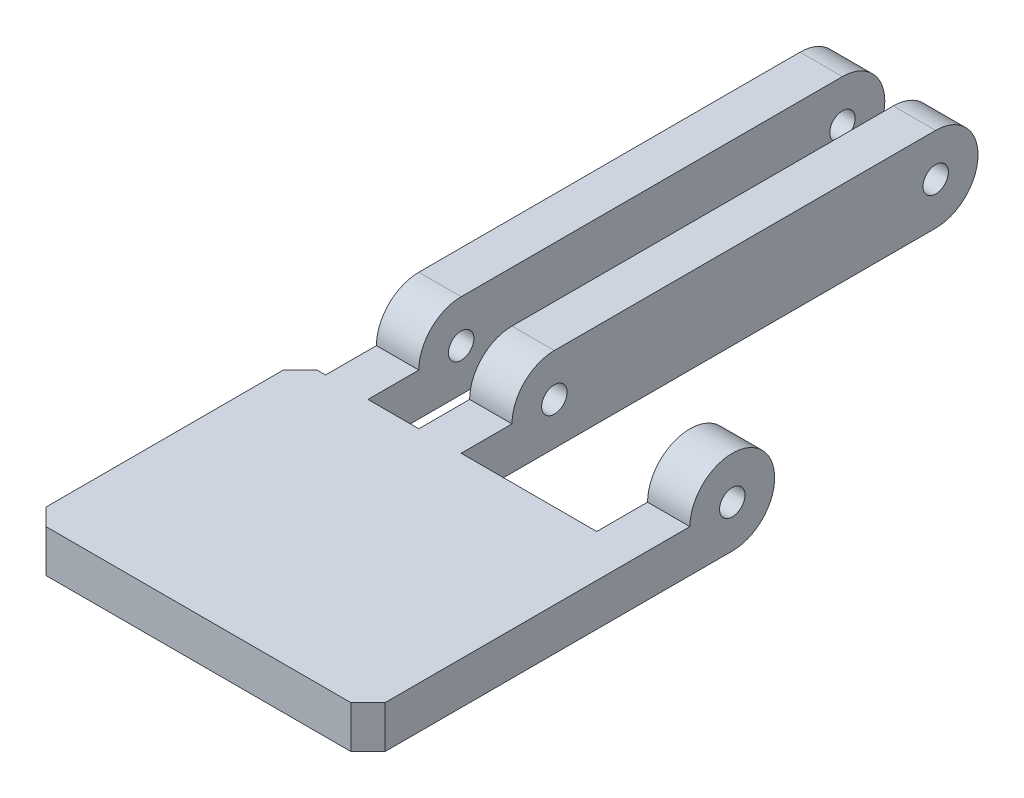
ISO-10303-21;
HEADER;
FILE_DESCRIPTION(('STEP AP214'),'2;1');
FILE_NAME('part.step','',(''),(''),'','','');
FILE_SCHEMA(('AUTOMOTIVE_DESIGN { 1 0 10303 214 1 1 1 1 }'));
ENDSEC;
DATA;
#1=APPLICATION_CONTEXT('core data for automotive mechanical design processes');
#2=APPLICATION_PROTOCOL_DEFINITION('international standard','automotive_design',2000,#1);
#3=PRODUCT_CONTEXT('',#1,'mechanical');
#4=PRODUCT('Part','Part','',(#3));
#5=PRODUCT_RELATED_PRODUCT_CATEGORY('part','',(#4));
#6=PRODUCT_DEFINITION_FORMATION('','',#4);
#7=PRODUCT_DEFINITION_CONTEXT('part definition',#1,'design');
#8=PRODUCT_DEFINITION('design','',#6,#7);
#9=PRODUCT_DEFINITION_SHAPE('','',#8);
#10=(LENGTH_UNIT() NAMED_UNIT(*) SI_UNIT(.MILLI.,.METRE.));
#11=(NAMED_UNIT(*) PLANE_ANGLE_UNIT() SI_UNIT($,.RADIAN.));
#12=(NAMED_UNIT(*) SI_UNIT($,.STERADIAN.) SOLID_ANGLE_UNIT());
#13=UNCERTAINTY_MEASURE_WITH_UNIT(LENGTH_MEASURE(1.E-05),#10,'distance_accuracy_value','');
#14=(GEOMETRIC_REPRESENTATION_CONTEXT(3) GLOBAL_UNCERTAINTY_ASSIGNED_CONTEXT((#13)) GLOBAL_UNIT_ASSIGNED_CONTEXT((#10,
#11,#12)) REPRESENTATION_CONTEXT('',''));
#15=CARTESIAN_POINT('',(0.,0.,0.));
#16=DIRECTION('',(0.,0.,1.));
#17=DIRECTION('',(1.,0.,0.));
#18=AXIS2_PLACEMENT_3D('',#15,#16,#17);
#19=CARTESIAN_POINT('',(-25.,5.,-18.));
#20=DIRECTION('',(1.,0.,0.));
#21=DIRECTION('',(0.,0.,-1.));
#22=AXIS2_PLACEMENT_3D('',#19,#20,#21);
#23=CYLINDRICAL_SURFACE('',#22,1.5);
#24=CARTESIAN_POINT('',(-22.,5.,-18.));
#25=DIRECTION('',(1.,0.,0.));
#26=DIRECTION('',(0.,0.,-1.));
#27=AXIS2_PLACEMENT_3D('',#24,#25,#26);
#28=CIRCLE('',#27,1.5);
#29=CARTESIAN_POINT('',(-22.,5.,-19.5));
#30=VERTEX_POINT('',#29);
#31=EDGE_CURVE('E349',#30,#30,#28,.T.);
#32=ORIENTED_EDGE('',*,*,#31,.F.);
#33=EDGE_LOOP('',(#32));
#34=FACE_BOUND('',#33,.T.);
#35=CARTESIAN_POINT('',(-17.,5.,-18.));
#36=DIRECTION('',(1.,0.,0.));
#37=DIRECTION('',(0.,0.,-1.));
#38=AXIS2_PLACEMENT_3D('',#35,#36,#37);
#39=CIRCLE('',#38,1.5);
#40=CARTESIAN_POINT('',(-17.,5.,-19.5));
#41=VERTEX_POINT('',#40);
#42=EDGE_CURVE('E262',#41,#41,#39,.T.);
#43=ORIENTED_EDGE('',*,*,#42,.T.);
#44=EDGE_LOOP('',(#43));
#45=FACE_BOUND('',#44,.T.);
#46=ADVANCED_FACE('F45',(#34,#45),#23,.F.);
#47=CARTESIAN_POINT('',(-11.,5.,-18.));
#48=DIRECTION('',(1.,0.,0.));
#49=DIRECTION('',(0.,0.,-1.));
#50=AXIS2_PLACEMENT_3D('',#47,#48,#49);
#51=CIRCLE('',#50,1.5);
#52=CARTESIAN_POINT('',(-11.,5.,-19.5));
#53=VERTEX_POINT('',#52);
#54=EDGE_CURVE('E265',#53,#53,#51,.T.);
#55=ORIENTED_EDGE('',*,*,#54,.F.);
#56=EDGE_LOOP('',(#55));
#57=FACE_BOUND('',#56,.T.);
#58=CARTESIAN_POINT('',(-6.,5.,-18.));
#59=DIRECTION('',(1.,0.,0.));
#60=DIRECTION('',(0.,0.,-1.));
#61=AXIS2_PLACEMENT_3D('',#58,#59,#60);
#62=CIRCLE('',#61,1.5);
#63=CARTESIAN_POINT('',(-6.,5.,-19.5));
#64=VERTEX_POINT('',#63);
#65=EDGE_CURVE('E268',#64,#64,#62,.T.);
#66=ORIENTED_EDGE('',*,*,#65,.T.);
#67=EDGE_LOOP('',(#66));
#68=FACE_BOUND('',#67,.T.);
#69=ADVANCED_FACE('F460',(#57,#68),#23,.F.);
#70=CARTESIAN_POINT('',(0.,5.,0.));
#71=DIRECTION('',(0.,1.,0.));
#72=DIRECTION('',(0.,0.,1.));
#73=AXIS2_PLACEMENT_3D('',#70,#71,#72);
#74=PLANE('',#73);
#75=DIRECTION('',(1.,0.,0.));
#76=VECTOR('',#75,1.);
#77=CARTESIAN_POINT('',(0.,5.,-7.00000000000001));
#78=LINE('',#77,#76);
#79=CARTESIAN_POINT('',(-23.,5.,-7.));
#80=VERTEX_POINT('',#79);
#81=CARTESIAN_POINT('',(-22.,5.,-7.));
#82=VERTEX_POINT('',#81);
#83=EDGE_CURVE('E217',#80,#82,#78,.T.);
#84=ORIENTED_EDGE('',*,*,#83,.F.);
#85=DIRECTION('',(0.707106781186547,0.,-0.707106781186548));
#86=VECTOR('',#85,1.);
#87=CARTESIAN_POINT('',(-15.,5.,-15.));
#88=LINE('',#87,#86);
#89=CARTESIAN_POINT('',(-25.,5.,-4.99999999999998));
#90=VERTEX_POINT('',#89);
#91=EDGE_CURVE('E368',#80,#90,#88,.F.);
#92=ORIENTED_EDGE('',*,*,#91,.T.);
#93=DIRECTION('',(0.,0.,1.));
#94=VECTOR('',#93,1.);
#95=CARTESIAN_POINT('',(-25.,5.,-18.));
#96=LINE('',#95,#94);
#97=CARTESIAN_POINT('',(-25.,5.,23.));
#98=VERTEX_POINT('',#97);
#99=EDGE_CURVE('E342',#90,#98,#96,.T.);
#100=ORIENTED_EDGE('',*,*,#99,.T.);
#101=DIRECTION('',(-0.707106781186547,0.,-0.707106781186548));
#102=VECTOR('',#101,1.);
#103=CARTESIAN_POINT('',(-24.,5.,24.));
#104=LINE('',#103,#102);
#105=CARTESIAN_POINT('',(-23.,5.,25.));
#106=VERTEX_POINT('',#105);
#107=EDGE_CURVE('E364',#98,#106,#104,.F.);
#108=ORIENTED_EDGE('',*,*,#107,.T.);
#109=DIRECTION('',(1.,0.,0.));
#110=VECTOR('',#109,1.);
#111=CARTESIAN_POINT('',(-25.,5.,25.));
#112=LINE('',#111,#110);
#113=CARTESIAN_POINT('',(13.,5.,25.));
#114=VERTEX_POINT('',#113);
#115=EDGE_CURVE('E345',#106,#114,#112,.T.);
#116=ORIENTED_EDGE('',*,*,#115,.T.);
#117=DIRECTION('',(0.707106781186546,0.,-0.707106781186549));
#118=VECTOR('',#117,1.);
#119=CARTESIAN_POINT('',(19.,5.,19.));
#120=LINE('',#119,#118);
#121=CARTESIAN_POINT('',(15.,5.,23.));
#122=VERTEX_POINT('',#121);
#123=EDGE_CURVE('E366',#114,#122,#120,.T.);
#124=ORIENTED_EDGE('',*,*,#123,.T.);
#125=DIRECTION('',(0.,0.,1.));
#126=VECTOR('',#125,1.);
#127=CARTESIAN_POINT('',(15.,5.,0.));
#128=LINE('',#127,#126);
#129=CARTESIAN_POINT('',(15.,5.,-13.));
#130=VERTEX_POINT('',#129);
#131=EDGE_CURVE('E218',#130,#122,#128,.T.);
#132=ORIENTED_EDGE('',*,*,#131,.F.);
#133=DIRECTION('',(1.,0.,0.));
#134=VECTOR('',#133,1.);
#135=CARTESIAN_POINT('',(10.,5.,-13.));
#136=LINE('',#135,#134);
#137=CARTESIAN_POINT('',(10.,5.,-13.));
#138=VERTEX_POINT('',#137);
#139=EDGE_CURVE('E337',#138,#130,#136,.T.);
#140=ORIENTED_EDGE('',*,*,#139,.F.);
#141=DIRECTION('',(0.,0.,-1.));
#142=VECTOR('',#141,1.);
#143=CARTESIAN_POINT('',(10.,5.,0.));
#144=LINE('',#143,#142);
#145=CARTESIAN_POINT('',(10.,5.,-7.));
#146=VERTEX_POINT('',#145);
#147=EDGE_CURVE('E221',#146,#138,#144,.T.);
#148=ORIENTED_EDGE('',*,*,#147,.F.);
#149=DIRECTION('',(1.,0.,0.));
#150=VECTOR('',#149,1.);
#151=CARTESIAN_POINT('',(0.,5.,-7.));
#152=LINE('',#151,#150);
#153=CARTESIAN_POINT('',(-6.,5.,-7.));
#154=VERTEX_POINT('',#153);
#155=EDGE_CURVE('E257',#154,#146,#152,.T.);
#156=ORIENTED_EDGE('',*,*,#155,.F.);
#157=DIRECTION('',(0.,0.,1.));
#158=VECTOR('',#157,1.);
#159=CARTESIAN_POINT('',(-6.,5.,0.));
#160=LINE('',#159,#158);
#161=CARTESIAN_POINT('',(-6.,5.,-13.));
#162=VERTEX_POINT('',#161);
#163=EDGE_CURVE('E249',#162,#154,#160,.T.);
#164=ORIENTED_EDGE('',*,*,#163,.F.);
#165=DIRECTION('',(1.,0.,0.));
#166=VECTOR('',#165,1.);
#167=CARTESIAN_POINT('',(-11.,5.,-13.));
#168=LINE('',#167,#166);
#169=CARTESIAN_POINT('',(-11.,5.,-13.));
#170=VERTEX_POINT('',#169);
#171=EDGE_CURVE('E328',#170,#162,#168,.T.);
#172=ORIENTED_EDGE('',*,*,#171,.F.);
#173=DIRECTION('',(0.,0.,-1.));
#174=VECTOR('',#173,1.);
#175=CARTESIAN_POINT('',(-11.,5.,0.));
#176=LINE('',#175,#174);
#177=CARTESIAN_POINT('',(-11.,5.,-7.));
#178=VERTEX_POINT('',#177);
#179=EDGE_CURVE('E251',#178,#170,#176,.T.);
#180=ORIENTED_EDGE('',*,*,#179,.F.);
#181=DIRECTION('',(1.,0.,0.));
#182=VECTOR('',#181,1.);
#183=CARTESIAN_POINT('',(0.,5.,-7.));
#184=LINE('',#183,#182);
#185=CARTESIAN_POINT('',(-17.,5.,-7.));
#186=VERTEX_POINT('',#185);
#187=EDGE_CURVE('E259',#186,#178,#184,.T.);
#188=ORIENTED_EDGE('',*,*,#187,.F.);
#189=DIRECTION('',(0.,0.,1.));
#190=VECTOR('',#189,1.);
#191=CARTESIAN_POINT('',(-17.,5.,0.));
#192=LINE('',#191,#190);
#193=CARTESIAN_POINT('',(-17.,5.,-13.));
#194=VERTEX_POINT('',#193);
#195=EDGE_CURVE('E253',#194,#186,#192,.T.);
#196=ORIENTED_EDGE('',*,*,#195,.F.);
#197=DIRECTION('',(-1.,0.,0.));
#198=VECTOR('',#197,1.);
#199=CARTESIAN_POINT('',(-17.,5.,-13.));
#200=LINE('',#199,#198);
#201=CARTESIAN_POINT('',(-22.,5.,-13.));
#202=VERTEX_POINT('',#201);
#203=EDGE_CURVE('E299',#194,#202,#200,.T.);
#204=ORIENTED_EDGE('',*,*,#203,.T.);
#205=DIRECTION('',(0.,0.,-1.));
#206=VECTOR('',#205,1.);
#207=CARTESIAN_POINT('',(-22.,5.,0.));
#208=LINE('',#207,#206);
#209=EDGE_CURVE('E255',#82,#202,#208,.T.);
#210=ORIENTED_EDGE('',*,*,#209,.F.);
#211=EDGE_LOOP('',(#84,#92,#100,#108,#116,#124,#132,#140,#148,#156,#164,#172,#180,#188,#196,
#204,#210));
#212=FACE_BOUND('',#211,.T.);
#213=ADVANCED_FACE('F385',(#212),#74,.T.);
#214=CARTESIAN_POINT('',(-25.,5.,-18.));
#215=DIRECTION('',(1.,0.,0.));
#216=DIRECTION('',(0.,0.,-1.));
#217=AXIS2_PLACEMENT_3D('',#214,#215,#216);
#218=PLANE('',#217);
#219=ORIENTED_EDGE('',*,*,#99,.F.);
#220=DIRECTION('',(0.,-1.,0.));
#221=VECTOR('',#220,1.);
#222=CARTESIAN_POINT('',(-25.,5.,-4.99999999999998));
#223=LINE('',#222,#221);
#224=CARTESIAN_POINT('',(-25.,0.,-4.99999999999998));
#225=VERTEX_POINT('',#224);
#226=EDGE_CURVE('E372',#90,#225,#223,.T.);
#227=ORIENTED_EDGE('',*,*,#226,.T.);
#228=DIRECTION('',(0.,0.,1.));
#229=VECTOR('',#228,1.);
#230=CARTESIAN_POINT('',(-25.,0.,-18.));
#231=LINE('',#230,#229);
#232=CARTESIAN_POINT('',(-25.,0.,23.));
#233=VERTEX_POINT('',#232);
#234=EDGE_CURVE('E352',#225,#233,#231,.T.);
#235=ORIENTED_EDGE('',*,*,#234,.T.);
#236=DIRECTION('',(0.,1.,0.));
#237=VECTOR('',#236,1.);
#238=CARTESIAN_POINT('',(-25.,5.,23.));
#239=LINE('',#238,#237);
#240=EDGE_CURVE('E370',#233,#98,#239,.T.);
#241=ORIENTED_EDGE('',*,*,#240,.T.);
#242=EDGE_LOOP('',(#219,#227,#235,#241));
#243=FACE_BOUND('',#242,.T.);
#244=ADVANCED_FACE('F390',(#243),#218,.F.);
#245=CARTESIAN_POINT('',(-25.,5.,25.));
#246=DIRECTION('',(0.,0.,-1.));
#247=DIRECTION('',(-1.,0.,0.));
#248=AXIS2_PLACEMENT_3D('',#245,#246,#247);
#249=PLANE('',#248);
#250=DIRECTION('',(1.,0.,0.));
#251=VECTOR('',#250,1.);
#252=CARTESIAN_POINT('',(-25.,0.,25.));
#253=LINE('',#252,#251);
#254=CARTESIAN_POINT('',(-23.,0.,25.));
#255=VERTEX_POINT('',#254);
#256=CARTESIAN_POINT('',(13.,0.,25.));
#257=VERTEX_POINT('',#256);
#258=EDGE_CURVE('E346',#255,#257,#253,.T.);
#259=ORIENTED_EDGE('',*,*,#258,.T.);
#260=DIRECTION('',(0.,1.,0.));
#261=VECTOR('',#260,1.);
#262=CARTESIAN_POINT('',(13.,5.,25.));
#263=LINE('',#262,#261);
#264=EDGE_CURVE('E54',#257,#114,#263,.T.);
#265=ORIENTED_EDGE('',*,*,#264,.T.);
#266=ORIENTED_EDGE('',*,*,#115,.F.);
#267=DIRECTION('',(0.,-1.,0.));
#268=VECTOR('',#267,1.);
#269=CARTESIAN_POINT('',(-23.,5.,25.));
#270=LINE('',#269,#268);
#271=EDGE_CURVE('E377',#106,#255,#270,.T.);
#272=ORIENTED_EDGE('',*,*,#271,.T.);
#273=EDGE_LOOP('',(#259,#265,#266,#272));
#274=FACE_BOUND('',#273,.T.);
#275=ADVANCED_FACE('F382',(#274),#249,.F.);
#276=CARTESIAN_POINT('',(0.,0.,0.));
#277=DIRECTION('',(0.,1.,0.));
#278=DIRECTION('',(0.,0.,1.));
#279=AXIS2_PLACEMENT_3D('',#276,#277,#278);
#280=PLANE('',#279);
#281=ORIENTED_EDGE('',*,*,#234,.F.);
#282=DIRECTION('',(-0.707106781186547,0.,0.707106781186548));
#283=VECTOR('',#282,1.);
#284=CARTESIAN_POINT('',(-23.,0.,-7.));
#285=LINE('',#284,#283);
#286=CARTESIAN_POINT('',(-23.,0.,-7.));
#287=VERTEX_POINT('',#286);
#288=EDGE_CURVE('E197',#225,#287,#285,.F.);
#289=ORIENTED_EDGE('',*,*,#288,.T.);
#290=DIRECTION('',(1.,0.,0.));
#291=VECTOR('',#290,1.);
#292=CARTESIAN_POINT('',(-25.,0.,-7.));
#293=LINE('',#292,#291);
#294=CARTESIAN_POINT('',(-22.,0.,-7.));
#295=VERTEX_POINT('',#294);
#296=EDGE_CURVE('E190',#287,#295,#293,.T.);
#297=ORIENTED_EDGE('',*,*,#296,.T.);
#298=DIRECTION('',(0.,0.,-1.));
#299=VECTOR('',#298,1.);
#300=CARTESIAN_POINT('',(-22.,0.,0.));
#301=LINE('',#300,#299);
#302=CARTESIAN_POINT('',(-22.,0.,-63.));
#303=VERTEX_POINT('',#302);
#304=EDGE_CURVE('E195',#295,#303,#301,.T.);
#305=ORIENTED_EDGE('',*,*,#304,.T.);
#306=DIRECTION('',(-1.,0.,0.));
#307=VECTOR('',#306,1.);
#308=CARTESIAN_POINT('',(-17.,0.,-63.));
#309=LINE('',#308,#307);
#310=CARTESIAN_POINT('',(-17.,0.,-63.));
#311=VERTEX_POINT('',#310);
#312=EDGE_CURVE('E297',#311,#303,#309,.T.);
#313=ORIENTED_EDGE('',*,*,#312,.F.);
#314=DIRECTION('',(0.,0.,-1.));
#315=VECTOR('',#314,1.);
#316=CARTESIAN_POINT('',(-17.,0.,0.));
#317=LINE('',#316,#315);
#318=CARTESIAN_POINT('',(-17.,0.,-7.));
#319=VERTEX_POINT('',#318);
#320=EDGE_CURVE('E276',#319,#311,#317,.T.);
#321=ORIENTED_EDGE('',*,*,#320,.F.);
#322=DIRECTION('',(1.,0.,0.));
#323=VECTOR('',#322,1.);
#324=CARTESIAN_POINT('',(-17.,0.,-7.));
#325=LINE('',#324,#323);
#326=CARTESIAN_POINT('',(-11.,0.,-7.));
#327=VERTEX_POINT('',#326);
#328=EDGE_CURVE('E203',#319,#327,#325,.T.);
#329=ORIENTED_EDGE('',*,*,#328,.T.);
#330=DIRECTION('',(0.,0.,-1.));
#331=VECTOR('',#330,1.);
#332=CARTESIAN_POINT('',(-11.,0.,-18.));
#333=LINE('',#332,#331);
#334=CARTESIAN_POINT('',(-11.,0.,-63.));
#335=VERTEX_POINT('',#334);
#336=EDGE_CURVE('E306',#327,#335,#333,.T.);
#337=ORIENTED_EDGE('',*,*,#336,.T.);
#338=DIRECTION('',(1.,0.,0.));
#339=VECTOR('',#338,1.);
#340=CARTESIAN_POINT('',(-11.,0.,-63.));
#341=LINE('',#340,#339);
#342=CARTESIAN_POINT('',(-6.,0.,-63.));
#343=VERTEX_POINT('',#342);
#344=EDGE_CURVE('E315',#335,#343,#341,.T.);
#345=ORIENTED_EDGE('',*,*,#344,.T.);
#346=DIRECTION('',(0.,0.,-1.));
#347=VECTOR('',#346,1.);
#348=CARTESIAN_POINT('',(-6.,0.,-18.));
#349=LINE('',#348,#347);
#350=CARTESIAN_POINT('',(-6.,0.,-7.));
#351=VERTEX_POINT('',#350);
#352=EDGE_CURVE('E318',#351,#343,#349,.T.);
#353=ORIENTED_EDGE('',*,*,#352,.F.);
#354=DIRECTION('',(1.,0.,0.));
#355=VECTOR('',#354,1.);
#356=CARTESIAN_POINT('',(-6.,0.,-7.));
#357=LINE('',#356,#355);
#358=CARTESIAN_POINT('',(10.,0.,-7.));
#359=VERTEX_POINT('',#358);
#360=EDGE_CURVE('E231',#351,#359,#357,.T.);
#361=ORIENTED_EDGE('',*,*,#360,.T.);
#362=DIRECTION('',(0.,0.,-1.));
#363=VECTOR('',#362,1.);
#364=CARTESIAN_POINT('',(10.,0.,-18.));
#365=LINE('',#364,#363);
#366=CARTESIAN_POINT('',(10.,0.,-18.));
#367=VERTEX_POINT('',#366);
#368=EDGE_CURVE('E237',#359,#367,#365,.T.);
#369=ORIENTED_EDGE('',*,*,#368,.T.);
#370=DIRECTION('',(-1.,0.,0.));
#371=VECTOR('',#370,1.);
#372=CARTESIAN_POINT('',(-25.,0.,-18.));
#373=LINE('',#372,#371);
#374=CARTESIAN_POINT('',(15.,0.,-18.));
#375=VERTEX_POINT('',#374);
#376=EDGE_CURVE('E341',#375,#367,#373,.T.);
#377=ORIENTED_EDGE('',*,*,#376,.F.);
#378=DIRECTION('',(0.,0.,1.));
#379=VECTOR('',#378,1.);
#380=CARTESIAN_POINT('',(15.,0.,-18.));
#381=LINE('',#380,#379);
#382=CARTESIAN_POINT('',(15.,0.,23.));
#383=VERTEX_POINT('',#382);
#384=EDGE_CURVE('E241',#375,#383,#381,.T.);
#385=ORIENTED_EDGE('',*,*,#384,.T.);
#386=DIRECTION('',(-0.707106781186546,0.,0.707106781186549));
#387=VECTOR('',#386,1.);
#388=CARTESIAN_POINT('',(13.,0.,25.));
#389=LINE('',#388,#387);
#390=EDGE_CURVE('E61',#383,#257,#389,.T.);
#391=ORIENTED_EDGE('',*,*,#390,.T.);
#392=ORIENTED_EDGE('',*,*,#258,.F.);
#393=DIRECTION('',(0.707106781186547,0.,0.707106781186548));
#394=VECTOR('',#393,1.);
#395=CARTESIAN_POINT('',(-23.,0.,25.));
#396=LINE('',#395,#394);
#397=EDGE_CURVE('E69',#255,#233,#396,.F.);
#398=ORIENTED_EDGE('',*,*,#397,.T.);
#399=EDGE_LOOP('',(#281,#289,#297,#305,#313,#321,#329,#337,#345,#353,#361,#369,#377,#385,#391,
#392,#398));
#400=FACE_BOUND('',#399,.T.);
#401=ADVANCED_FACE('F193',(#400),#280,.F.);
#402=CARTESIAN_POINT('',(10.,5.,-18.));
#403=DIRECTION('',(1.,0.,0.));
#404=DIRECTION('',(0.,0.,-1.));
#405=AXIS2_PLACEMENT_3D('',#402,#403,#404);
#406=PLANE('',#405);
#407=CARTESIAN_POINT('',(9.99999999999999,5.,-18.));
#408=DIRECTION('',(1.,0.,0.));
#409=DIRECTION('',(0.,0.,-1.));
#410=AXIS2_PLACEMENT_3D('',#407,#408,#409);
#411=CIRCLE('',#410,1.5);
#412=CARTESIAN_POINT('',(9.99999999999999,5.,-19.5));
#413=VERTEX_POINT('',#412);
#414=EDGE_CURVE('E271',#413,#413,#411,.T.);
#415=ORIENTED_EDGE('',*,*,#414,.T.);
#416=EDGE_LOOP('',(#415));
#417=FACE_BOUND('',#416,.T.);
#418=ORIENTED_EDGE('',*,*,#147,.T.);
#419=CARTESIAN_POINT('',(10.,5.,-18.));
#420=DIRECTION('',(1.,0.,0.));
#421=DIRECTION('',(0.,0.,-1.));
#422=AXIS2_PLACEMENT_3D('',#419,#420,#421);
#423=CIRCLE('',#422,5.);
#424=EDGE_CURVE('E335',#367,#138,#423,.T.);
#425=ORIENTED_EDGE('',*,*,#424,.F.);
#426=ORIENTED_EDGE('',*,*,#368,.F.);
#427=DIRECTION('',(0.,1.,0.));
#428=VECTOR('',#427,1.);
#429=CARTESIAN_POINT('',(10.,0.,-7.));
#430=LINE('',#429,#428);
#431=EDGE_CURVE('E238',#359,#146,#430,.T.);
#432=ORIENTED_EDGE('',*,*,#431,.T.);
#433=EDGE_LOOP('',(#418,#425,#426,#432));
#434=FACE_BOUND('',#433,.T.);
#435=ADVANCED_FACE('F441',(#417,#434),#406,.F.);
#436=CARTESIAN_POINT('',(15.,5.,-18.));
#437=DIRECTION('',(1.,0.,0.));
#438=DIRECTION('',(0.,0.,-1.));
#439=AXIS2_PLACEMENT_3D('',#436,#437,#438);
#440=PLANE('',#439);
#441=CARTESIAN_POINT('',(15.,5.,-18.));
#442=DIRECTION('',(1.,0.,0.));
#443=DIRECTION('',(0.,0.,-1.));
#444=AXIS2_PLACEMENT_3D('',#441,#442,#443);
#445=CIRCLE('',#444,1.5);
#446=CARTESIAN_POINT('',(15.,5.,-19.5));
#447=VERTEX_POINT('',#446);
#448=EDGE_CURVE('E213',#447,#447,#445,.T.);
#449=ORIENTED_EDGE('',*,*,#448,.F.);
#450=EDGE_LOOP('',(#449));
#451=FACE_BOUND('',#450,.T.);
#452=ORIENTED_EDGE('',*,*,#131,.T.);
#453=DIRECTION('',(0.,-1.,0.));
#454=VECTOR('',#453,1.);
#455=CARTESIAN_POINT('',(15.,0.,23.));
#456=LINE('',#455,#454);
#457=EDGE_CURVE('E11',#122,#383,#456,.T.);
#458=ORIENTED_EDGE('',*,*,#457,.T.);
#459=ORIENTED_EDGE('',*,*,#384,.F.);
#460=CARTESIAN_POINT('',(15.,5.,-18.));
#461=DIRECTION('',(1.,0.,0.));
#462=DIRECTION('',(0.,0.,-1.));
#463=AXIS2_PLACEMENT_3D('',#460,#461,#462);
#464=CIRCLE('',#463,5.);
#465=EDGE_CURVE('E334',#375,#130,#464,.T.);
#466=ORIENTED_EDGE('',*,*,#465,.T.);
#467=EDGE_LOOP('',(#452,#458,#459,#466));
#468=FACE_BOUND('',#467,.T.);
#469=ADVANCED_FACE('F448',(#451,#468),#440,.T.);
#470=CARTESIAN_POINT('',(10.,5.,-18.));
#471=DIRECTION('',(1.,0.,0.));
#472=DIRECTION('',(0.,0.,-1.));
#473=AXIS2_PLACEMENT_3D('',#470,#471,#472);
#474=CYLINDRICAL_SURFACE('',#473,5.);
#475=ORIENTED_EDGE('',*,*,#424,.T.);
#476=ORIENTED_EDGE('',*,*,#139,.T.);
#477=ORIENTED_EDGE('',*,*,#465,.F.);
#478=ORIENTED_EDGE('',*,*,#376,.T.);
#479=EDGE_LOOP('',(#475,#476,#477,#478));
#480=FACE_BOUND('',#479,.T.);
#481=ADVANCED_FACE('F445',(#480),#474,.T.);
#482=CARTESIAN_POINT('',(-11.,5.,-18.));
#483=DIRECTION('',(1.,0.,0.));
#484=DIRECTION('',(0.,0.,-1.));
#485=AXIS2_PLACEMENT_3D('',#482,#483,#484);
#486=PLANE('',#485);
#487=CARTESIAN_POINT('',(-11.,5.,-63.));
#488=DIRECTION('',(1.,0.,0.));
#489=DIRECTION('',(0.,0.,-1.));
#490=AXIS2_PLACEMENT_3D('',#487,#488,#489);
#491=CIRCLE('',#490,1.5);
#492=CARTESIAN_POINT('',(-11.,5.,-64.5));
#493=VERTEX_POINT('',#492);
#494=EDGE_CURVE('E245',#493,#493,#491,.T.);
#495=ORIENTED_EDGE('',*,*,#494,.T.);
#496=EDGE_LOOP('',(#495));
#497=FACE_BOUND('',#496,.T.);
#498=ORIENTED_EDGE('',*,*,#54,.T.);
#499=EDGE_LOOP('',(#498));
#500=FACE_BOUND('',#499,.T.);
#501=ORIENTED_EDGE('',*,*,#179,.T.);
#502=CARTESIAN_POINT('',(-11.,5.,-18.));
#503=DIRECTION('',(1.,0.,0.));
#504=DIRECTION('',(0.,0.,-1.));
#505=AXIS2_PLACEMENT_3D('',#502,#503,#504);
#506=CIRCLE('',#505,5.);
#507=CARTESIAN_POINT('',(-11.,10.,-18.));
#508=VERTEX_POINT('',#507);
#509=EDGE_CURVE('E303',#508,#170,#506,.T.);
#510=ORIENTED_EDGE('',*,*,#509,.F.);
#511=DIRECTION('',(0.,0.,-1.));
#512=VECTOR('',#511,1.);
#513=CARTESIAN_POINT('',(-11.,10.,-18.));
#514=LINE('',#513,#512);
#515=CARTESIAN_POINT('',(-11.,10.,-63.));
#516=VERTEX_POINT('',#515);
#517=EDGE_CURVE('E313',#508,#516,#514,.T.);
#518=ORIENTED_EDGE('',*,*,#517,.T.);
#519=CARTESIAN_POINT('',(-11.,5.,-63.));
#520=DIRECTION('',(1.,0.,0.));
#521=DIRECTION('',(0.,0.,-1.));
#522=AXIS2_PLACEMENT_3D('',#519,#520,#521);
#523=CIRCLE('',#522,5.);
#524=EDGE_CURVE('E310',#335,#516,#523,.T.);
#525=ORIENTED_EDGE('',*,*,#524,.F.);
#526=ORIENTED_EDGE('',*,*,#336,.F.);
#527=DIRECTION('',(0.,1.,0.));
#528=VECTOR('',#527,1.);
#529=CARTESIAN_POINT('',(-11.,0.,-7.));
#530=LINE('',#529,#528);
#531=EDGE_CURVE('E228',#327,#178,#530,.T.);
#532=ORIENTED_EDGE('',*,*,#531,.T.);
#533=EDGE_LOOP('',(#501,#510,#518,#525,#526,#532));
#534=FACE_BOUND('',#533,.T.);
#535=ADVANCED_FACE('F415',(#497,#500,#534),#486,.F.);
#536=CARTESIAN_POINT('',(-6.,5.,-18.));
#537=DIRECTION('',(1.,0.,0.));
#538=DIRECTION('',(0.,0.,-1.));
#539=AXIS2_PLACEMENT_3D('',#536,#537,#538);
#540=PLANE('',#539);
#541=CARTESIAN_POINT('',(-6.,5.,-63.));
#542=DIRECTION('',(1.,0.,0.));
#543=DIRECTION('',(0.,0.,-1.));
#544=AXIS2_PLACEMENT_3D('',#541,#542,#543);
#545=CIRCLE('',#544,1.5);
#546=CARTESIAN_POINT('',(-6.,5.,-64.5));
#547=VERTEX_POINT('',#546);
#548=EDGE_CURVE('E850',#547,#547,#545,.T.);
#549=ORIENTED_EDGE('',*,*,#548,.F.);
#550=EDGE_LOOP('',(#549));
#551=FACE_BOUND('',#550,.T.);
#552=ORIENTED_EDGE('',*,*,#65,.F.);
#553=EDGE_LOOP('',(#552));
#554=FACE_BOUND('',#553,.T.);
#555=DIRECTION('',(0.,0.,-1.));
#556=VECTOR('',#555,1.);
#557=CARTESIAN_POINT('',(-6.,10.,-18.));
#558=LINE('',#557,#556);
#559=CARTESIAN_POINT('',(-6.,10.,-18.));
#560=VERTEX_POINT('',#559);
#561=CARTESIAN_POINT('',(-6.,10.,-63.));
#562=VERTEX_POINT('',#561);
#563=EDGE_CURVE('E307',#560,#562,#558,.T.);
#564=ORIENTED_EDGE('',*,*,#563,.F.);
#565=CARTESIAN_POINT('',(-6.,5.,-18.));
#566=DIRECTION('',(1.,0.,0.));
#567=DIRECTION('',(0.,0.,-1.));
#568=AXIS2_PLACEMENT_3D('',#565,#566,#567);
#569=CIRCLE('',#568,5.);
#570=EDGE_CURVE('E302',#560,#162,#569,.T.);
#571=ORIENTED_EDGE('',*,*,#570,.T.);
#572=ORIENTED_EDGE('',*,*,#163,.T.);
#573=DIRECTION('',(0.,1.,0.));
#574=VECTOR('',#573,1.);
#575=CARTESIAN_POINT('',(-6.,0.,-7.));
#576=LINE('',#575,#574);
#577=EDGE_CURVE('E234',#351,#154,#576,.T.);
#578=ORIENTED_EDGE('',*,*,#577,.F.);
#579=ORIENTED_EDGE('',*,*,#352,.T.);
#580=CARTESIAN_POINT('',(-6.,5.,-63.));
#581=DIRECTION('',(1.,0.,0.));
#582=DIRECTION('',(0.,0.,-1.));
#583=AXIS2_PLACEMENT_3D('',#580,#581,#582);
#584=CIRCLE('',#583,5.);
#585=EDGE_CURVE('E321',#343,#562,#584,.T.);
#586=ORIENTED_EDGE('',*,*,#585,.T.);
#587=EDGE_LOOP('',(#564,#571,#572,#578,#579,#586));
#588=FACE_BOUND('',#587,.T.);
#589=ADVANCED_FACE('F434',(#551,#554,#588),#540,.T.);
#590=CARTESIAN_POINT('',(-11.,5.,-18.));
#591=DIRECTION('',(1.,0.,0.));
#592=DIRECTION('',(0.,0.,-1.));
#593=AXIS2_PLACEMENT_3D('',#590,#591,#592);
#594=CYLINDRICAL_SURFACE('',#593,5.);
#595=ORIENTED_EDGE('',*,*,#509,.T.);
#596=ORIENTED_EDGE('',*,*,#171,.T.);
#597=ORIENTED_EDGE('',*,*,#570,.F.);
#598=DIRECTION('',(1.,0.,0.));
#599=VECTOR('',#598,1.);
#600=CARTESIAN_POINT('',(-11.,10.,-18.));
#601=LINE('',#600,#599);
#602=EDGE_CURVE('E326',#508,#560,#601,.T.);
#603=ORIENTED_EDGE('',*,*,#602,.F.);
#604=EDGE_LOOP('',(#595,#596,#597,#603));
#605=FACE_BOUND('',#604,.T.);
#606=ADVANCED_FACE('F422',(#605),#594,.T.);
#607=CARTESIAN_POINT('',(-11.,10.,-18.));
#608=DIRECTION('',(0.,-1.,0.));
#609=DIRECTION('',(0.,0.,-1.));
#610=AXIS2_PLACEMENT_3D('',#607,#608,#609);
#611=PLANE('',#610);
#612=ORIENTED_EDGE('',*,*,#563,.T.);
#613=DIRECTION('',(1.,0.,0.));
#614=VECTOR('',#613,1.);
#615=CARTESIAN_POINT('',(-11.,10.,-63.));
#616=LINE('',#615,#614);
#617=EDGE_CURVE('E329',#516,#562,#616,.T.);
#618=ORIENTED_EDGE('',*,*,#617,.F.);
#619=ORIENTED_EDGE('',*,*,#517,.F.);
#620=ORIENTED_EDGE('',*,*,#602,.T.);
#621=EDGE_LOOP('',(#612,#618,#619,#620));
#622=FACE_BOUND('',#621,.T.);
#623=ADVANCED_FACE('F426',(#622),#611,.F.);
#624=CARTESIAN_POINT('',(-11.,5.,-63.));
#625=DIRECTION('',(1.,0.,0.));
#626=DIRECTION('',(0.,0.,-1.));
#627=AXIS2_PLACEMENT_3D('',#624,#625,#626);
#628=CYLINDRICAL_SURFACE('',#627,5.);
#629=ORIENTED_EDGE('',*,*,#585,.F.);
#630=ORIENTED_EDGE('',*,*,#344,.F.);
#631=ORIENTED_EDGE('',*,*,#524,.T.);
#632=ORIENTED_EDGE('',*,*,#617,.T.);
#633=EDGE_LOOP('',(#629,#630,#631,#632));
#634=FACE_BOUND('',#633,.T.);
#635=ADVANCED_FACE('F430',(#634),#628,.T.);
#636=CARTESIAN_POINT('',(-17.,0.,0.));
#637=DIRECTION('',(1.,0.,0.));
#638=DIRECTION('',(0.,0.,-1.));
#639=AXIS2_PLACEMENT_3D('',#636,#637,#638);
#640=PLANE('',#639);
#641=CARTESIAN_POINT('',(-17.,5.,-63.));
#642=DIRECTION('',(1.,0.,0.));
#643=DIRECTION('',(0.,0.,-1.));
#644=AXIS2_PLACEMENT_3D('',#641,#642,#643);
#645=CIRCLE('',#644,1.5);
#646=CARTESIAN_POINT('',(-17.,5.,-64.5));
#647=VERTEX_POINT('',#646);
#648=EDGE_CURVE('E362',#647,#647,#645,.T.);
#649=ORIENTED_EDGE('',*,*,#648,.F.);
#650=EDGE_LOOP('',(#649));
#651=FACE_BOUND('',#650,.T.);
#652=ORIENTED_EDGE('',*,*,#42,.F.);
#653=EDGE_LOOP('',(#652));
#654=FACE_BOUND('',#653,.T.);
#655=DIRECTION('',(0.,0.,-1.));
#656=VECTOR('',#655,1.);
#657=CARTESIAN_POINT('',(-17.,10.,0.));
#658=LINE('',#657,#656);
#659=CARTESIAN_POINT('',(-17.,10.,-18.));
#660=VERTEX_POINT('',#659);
#661=CARTESIAN_POINT('',(-17.,10.,-63.));
#662=VERTEX_POINT('',#661);
#663=EDGE_CURVE('E282',#660,#662,#658,.T.);
#664=ORIENTED_EDGE('',*,*,#663,.F.);
#665=CARTESIAN_POINT('',(-17.,5.,-18.));
#666=DIRECTION('',(1.,0.,0.));
#667=DIRECTION('',(0.,0.,-1.));
#668=AXIS2_PLACEMENT_3D('',#665,#666,#667);
#669=CIRCLE('',#668,4.99999999999999);
#670=EDGE_CURVE('E285',#660,#194,#669,.T.);
#671=ORIENTED_EDGE('',*,*,#670,.T.);
#672=ORIENTED_EDGE('',*,*,#195,.T.);
#673=DIRECTION('',(0.,1.,0.));
#674=VECTOR('',#673,1.);
#675=CARTESIAN_POINT('',(-17.,0.,-7.));
#676=LINE('',#675,#674);
#677=EDGE_CURVE('E225',#319,#186,#676,.T.);
#678=ORIENTED_EDGE('',*,*,#677,.F.);
#679=ORIENTED_EDGE('',*,*,#320,.T.);
#680=CARTESIAN_POINT('',(-17.,5.,-63.));
#681=DIRECTION('',(1.,0.,0.));
#682=DIRECTION('',(0.,0.,-1.));
#683=AXIS2_PLACEMENT_3D('',#680,#681,#682);
#684=CIRCLE('',#683,5.);
#685=EDGE_CURVE('E279',#311,#662,#684,.T.);
#686=ORIENTED_EDGE('',*,*,#685,.T.);
#687=EDGE_LOOP('',(#664,#671,#672,#678,#679,#686));
#688=FACE_BOUND('',#687,.T.);
#689=ADVANCED_FACE('F408',(#651,#654,#688),#640,.T.);
#690=CARTESIAN_POINT('',(-22.,0.,0.));
#691=DIRECTION('',(1.,0.,0.));
#692=DIRECTION('',(0.,0.,-1.));
#693=AXIS2_PLACEMENT_3D('',#690,#691,#692);
#694=PLANE('',#693);
#695=CARTESIAN_POINT('',(-22.,5.,-63.));
#696=DIRECTION('',(1.,0.,0.));
#697=DIRECTION('',(0.,0.,-1.));
#698=AXIS2_PLACEMENT_3D('',#695,#696,#697);
#699=CIRCLE('',#698,1.5);
#700=CARTESIAN_POINT('',(-22.,5.,-64.5));
#701=VERTEX_POINT('',#700);
#702=EDGE_CURVE('E359',#701,#701,#699,.T.);
#703=ORIENTED_EDGE('',*,*,#702,.T.);
#704=EDGE_LOOP('',(#703));
#705=FACE_BOUND('',#704,.T.);
#706=ORIENTED_EDGE('',*,*,#31,.T.);
#707=EDGE_LOOP('',(#706));
#708=FACE_BOUND('',#707,.T.);
#709=ORIENTED_EDGE('',*,*,#209,.T.);
#710=CARTESIAN_POINT('',(-22.,5.,-18.));
#711=DIRECTION('',(1.,0.,0.));
#712=DIRECTION('',(0.,0.,-1.));
#713=AXIS2_PLACEMENT_3D('',#710,#711,#712);
#714=CIRCLE('',#713,4.99999999999999);
#715=CARTESIAN_POINT('',(-22.,10.,-18.));
#716=VERTEX_POINT('',#715);
#717=EDGE_CURVE('E280',#716,#202,#714,.T.);
#718=ORIENTED_EDGE('',*,*,#717,.F.);
#719=DIRECTION('',(0.,0.,-1.));
#720=VECTOR('',#719,1.);
#721=CARTESIAN_POINT('',(-22.,10.,0.));
#722=LINE('',#721,#720);
#723=CARTESIAN_POINT('',(-22.,10.,-63.));
#724=VERTEX_POINT('',#723);
#725=EDGE_CURVE('E290',#716,#724,#722,.T.);
#726=ORIENTED_EDGE('',*,*,#725,.T.);
#727=CARTESIAN_POINT('',(-22.,5.,-63.));
#728=DIRECTION('',(1.,0.,0.));
#729=DIRECTION('',(0.,0.,-1.));
#730=AXIS2_PLACEMENT_3D('',#727,#728,#729);
#731=CIRCLE('',#730,5.);
#732=EDGE_CURVE('E211',#303,#724,#731,.T.);
#733=ORIENTED_EDGE('',*,*,#732,.F.);
#734=ORIENTED_EDGE('',*,*,#304,.F.);
#735=DIRECTION('',(0.,1.,0.));
#736=VECTOR('',#735,1.);
#737=CARTESIAN_POINT('',(-22.,0.,-7.));
#738=LINE('',#737,#736);
#739=EDGE_CURVE('E202',#295,#82,#738,.T.);
#740=ORIENTED_EDGE('',*,*,#739,.T.);
#741=EDGE_LOOP('',(#709,#718,#726,#733,#734,#740));
#742=FACE_BOUND('',#741,.T.);
#743=ADVANCED_FACE('F207',(#705,#708,#742),#694,.F.);
#744=CARTESIAN_POINT('',(-17.,5.,-63.));
#745=DIRECTION('',(-1.,0.,0.));
#746=DIRECTION('',(0.,0.,1.));
#747=AXIS2_PLACEMENT_3D('',#744,#745,#746);
#748=CYLINDRICAL_SURFACE('',#747,5.);
#749=ORIENTED_EDGE('',*,*,#732,.T.);
#750=DIRECTION('',(-1.,0.,0.));
#751=VECTOR('',#750,1.);
#752=CARTESIAN_POINT('',(-17.,10.,-63.));
#753=LINE('',#752,#751);
#754=EDGE_CURVE('E295',#662,#724,#753,.T.);
#755=ORIENTED_EDGE('',*,*,#754,.F.);
#756=ORIENTED_EDGE('',*,*,#685,.F.);
#757=ORIENTED_EDGE('',*,*,#312,.T.);
#758=EDGE_LOOP('',(#749,#755,#756,#757));
#759=FACE_BOUND('',#758,.T.);
#760=ADVANCED_FACE('F404',(#759),#748,.T.);
#761=CARTESIAN_POINT('',(-17.,10.,0.));
#762=DIRECTION('',(0.,1.,0.));
#763=DIRECTION('',(0.,0.,1.));
#764=AXIS2_PLACEMENT_3D('',#761,#762,#763);
#765=PLANE('',#764);
#766=ORIENTED_EDGE('',*,*,#725,.F.);
#767=DIRECTION('',(-1.,0.,0.));
#768=VECTOR('',#767,1.);
#769=CARTESIAN_POINT('',(-17.,10.,-18.));
#770=LINE('',#769,#768);
#771=EDGE_CURVE('E287',#660,#716,#770,.T.);
#772=ORIENTED_EDGE('',*,*,#771,.F.);
#773=ORIENTED_EDGE('',*,*,#663,.T.);
#774=ORIENTED_EDGE('',*,*,#754,.T.);
#775=EDGE_LOOP('',(#766,#772,#773,#774));
#776=FACE_BOUND('',#775,.T.);
#777=ADVANCED_FACE('F399',(#776),#765,.T.);
#778=CARTESIAN_POINT('',(-17.,5.,-18.));
#779=DIRECTION('',(-1.,0.,0.));
#780=DIRECTION('',(0.,0.,1.));
#781=AXIS2_PLACEMENT_3D('',#778,#779,#780);
#782=CYLINDRICAL_SURFACE('',#781,4.99999999999999);
#783=ORIENTED_EDGE('',*,*,#203,.F.);
#784=ORIENTED_EDGE('',*,*,#670,.F.);
#785=ORIENTED_EDGE('',*,*,#771,.T.);
#786=ORIENTED_EDGE('',*,*,#717,.T.);
#787=EDGE_LOOP('',(#783,#784,#785,#786));
#788=FACE_BOUND('',#787,.T.);
#789=ADVANCED_FACE('F473',(#788),#782,.T.);
#790=ORIENTED_EDGE('',*,*,#448,.T.);
#791=EDGE_LOOP('',(#790));
#792=FACE_BOUND('',#791,.T.);
#793=ORIENTED_EDGE('',*,*,#414,.F.);
#794=EDGE_LOOP('',(#793));
#795=FACE_BOUND('',#794,.T.);
#796=ADVANCED_FACE('F463',(#792,#795),#23,.F.);
#797=CARTESIAN_POINT('',(-6.,0.,-7.));
#798=DIRECTION('',(0.,0.,1.));
#799=DIRECTION('',(1.,0.,0.));
#800=AXIS2_PLACEMENT_3D('',#797,#798,#799);
#801=PLANE('',#800);
#802=ORIENTED_EDGE('',*,*,#155,.T.);
#803=ORIENTED_EDGE('',*,*,#431,.F.);
#804=ORIENTED_EDGE('',*,*,#360,.F.);
#805=ORIENTED_EDGE('',*,*,#577,.T.);
#806=EDGE_LOOP('',(#802,#803,#804,#805));
#807=FACE_BOUND('',#806,.T.);
#808=ADVANCED_FACE('F436',(#807),#801,.F.);
#809=CARTESIAN_POINT('',(-17.,0.,-7.));
#810=DIRECTION('',(0.,0.,1.));
#811=DIRECTION('',(1.,0.,0.));
#812=AXIS2_PLACEMENT_3D('',#809,#810,#811);
#813=PLANE('',#812);
#814=ORIENTED_EDGE('',*,*,#187,.T.);
#815=ORIENTED_EDGE('',*,*,#531,.F.);
#816=ORIENTED_EDGE('',*,*,#328,.F.);
#817=ORIENTED_EDGE('',*,*,#677,.T.);
#818=EDGE_LOOP('',(#814,#815,#816,#817));
#819=FACE_BOUND('',#818,.T.);
#820=ADVANCED_FACE('F412',(#819),#813,.F.);
#821=CARTESIAN_POINT('',(-25.,0.,-7.));
#822=DIRECTION('',(0.,0.,1.));
#823=DIRECTION('',(1.,0.,0.));
#824=AXIS2_PLACEMENT_3D('',#821,#822,#823);
#825=PLANE('',#824);
#826=ORIENTED_EDGE('',*,*,#296,.F.);
#827=DIRECTION('',(0.,1.,0.));
#828=VECTOR('',#827,1.);
#829=CARTESIAN_POINT('',(-23.,0.,-7.));
#830=LINE('',#829,#828);
#831=EDGE_CURVE('E358',#287,#80,#830,.T.);
#832=ORIENTED_EDGE('',*,*,#831,.T.);
#833=ORIENTED_EDGE('',*,*,#83,.T.);
#834=ORIENTED_EDGE('',*,*,#739,.F.);
#835=EDGE_LOOP('',(#826,#832,#833,#834));
#836=FACE_BOUND('',#835,.T.);
#837=ADVANCED_FACE('F215',(#836),#825,.F.);
#838=CARTESIAN_POINT('',(-25.,5.,-63.));
#839=DIRECTION('',(1.,0.,0.));
#840=DIRECTION('',(0.,0.,-1.));
#841=AXIS2_PLACEMENT_3D('',#838,#839,#840);
#842=CYLINDRICAL_SURFACE('',#841,1.5);
#843=ORIENTED_EDGE('',*,*,#648,.T.);
#844=EDGE_LOOP('',(#843));
#845=FACE_BOUND('',#844,.T.);
#846=ORIENTED_EDGE('',*,*,#702,.F.);
#847=EDGE_LOOP('',(#846));
#848=FACE_BOUND('',#847,.T.);
#849=ADVANCED_FACE('F647',(#845,#848),#842,.F.);
#850=ORIENTED_EDGE('',*,*,#548,.T.);
#851=EDGE_LOOP('',(#850));
#852=FACE_BOUND('',#851,.T.);
#853=ORIENTED_EDGE('',*,*,#494,.F.);
#854=EDGE_LOOP('',(#853));
#855=FACE_BOUND('',#854,.T.);
#856=ADVANCED_FACE('F456',(#852,#855),#842,.F.);
#857=CARTESIAN_POINT('',(-23.,0.,-7.));
#858=DIRECTION('',(0.707106781186548,0.,0.707106781186547));
#859=DIRECTION('',(0.,1.,0.));
#860=AXIS2_PLACEMENT_3D('',#857,#858,#859);
#861=PLANE('',#860);
#862=ORIENTED_EDGE('',*,*,#288,.F.);
#863=ORIENTED_EDGE('',*,*,#226,.F.);
#864=ORIENTED_EDGE('',*,*,#91,.F.);
#865=ORIENTED_EDGE('',*,*,#831,.F.);
#866=EDGE_LOOP('',(#862,#863,#864,#865));
#867=FACE_BOUND('',#866,.T.);
#868=ADVANCED_FACE('F393',(#867),#861,.F.);
#869=CARTESIAN_POINT('',(13.,5.,25.));
#870=DIRECTION('',(0.707106781186549,0.,0.707106781186546));
#871=DIRECTION('',(0.,-1.,0.));
#872=AXIS2_PLACEMENT_3D('',#869,#870,#871);
#873=PLANE('',#872);
#874=ORIENTED_EDGE('',*,*,#390,.F.);
#875=ORIENTED_EDGE('',*,*,#457,.F.);
#876=ORIENTED_EDGE('',*,*,#123,.F.);
#877=ORIENTED_EDGE('',*,*,#264,.F.);
#878=EDGE_LOOP('',(#874,#875,#876,#877));
#879=FACE_BOUND('',#878,.T.);
#880=ADVANCED_FACE('F450',(#879),#873,.T.);
#881=CARTESIAN_POINT('',(-23.,5.,25.));
#882=DIRECTION('',(0.707106781186548,0.,-0.707106781186547));
#883=DIRECTION('',(0.,-1.,0.));
#884=AXIS2_PLACEMENT_3D('',#881,#882,#883);
#885=PLANE('',#884);
#886=ORIENTED_EDGE('',*,*,#107,.F.);
#887=ORIENTED_EDGE('',*,*,#240,.F.);
#888=ORIENTED_EDGE('',*,*,#397,.F.);
#889=ORIENTED_EDGE('',*,*,#271,.F.);
#890=EDGE_LOOP('',(#886,#887,#888,#889));
#891=FACE_BOUND('',#890,.T.);
#892=ADVANCED_FACE('F48',(#891),#885,.F.);
#893=CLOSED_SHELL('',(#46,#69,#213,#244,#275,#401,#435,#469,#481,#535,#589,#606,#623,#635,#689,
#743,#760,#777,#789,#796,#808,#820,#837,#849,#856,#868,#880,#892));
#894=MANIFOLD_SOLID_BREP('B2',#893);
#895=ADVANCED_BREP_SHAPE_REPRESENTATION('',(#18,#894),#14);
#896=SHAPE_DEFINITION_REPRESENTATION(#9,#895);
ENDSEC;
END-ISO-10303-21;
